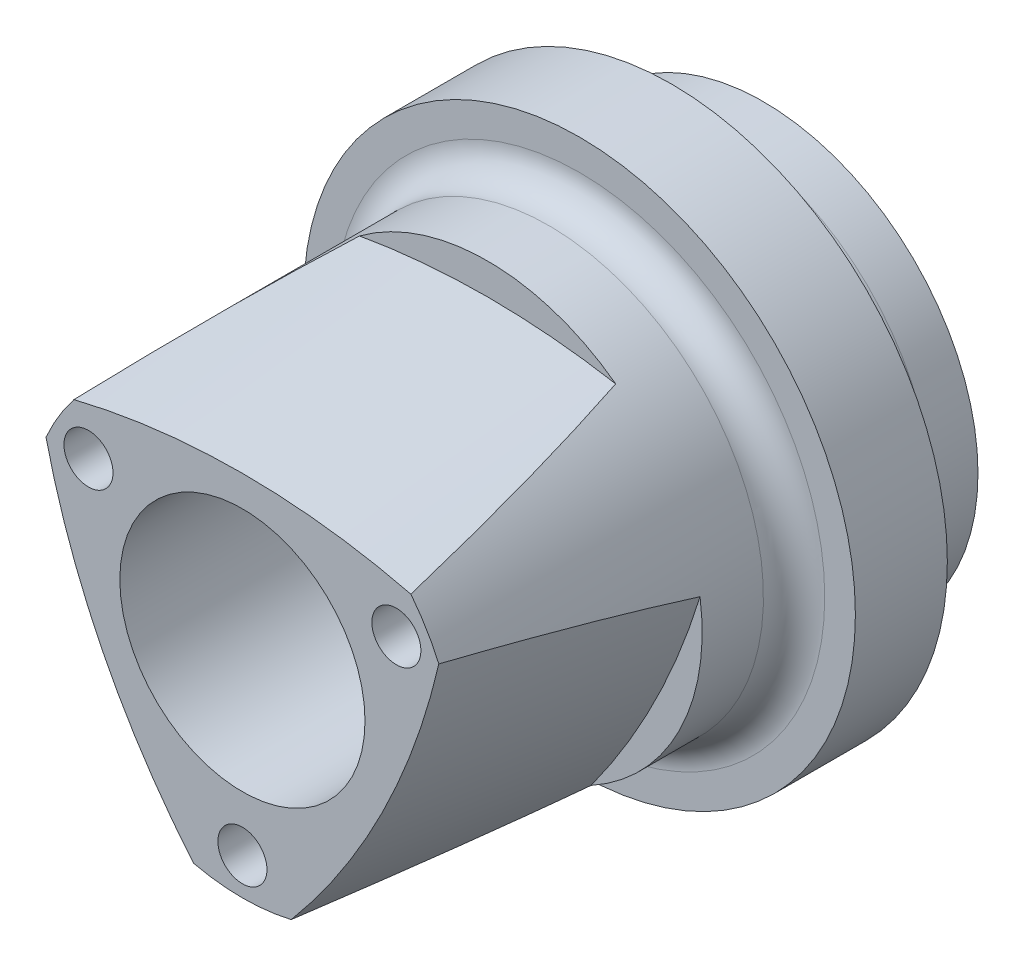
ISO-10303-21;
HEADER;
FILE_DESCRIPTION(('STEP AP214'),'2;1');
FILE_NAME('part.step','',(''),(''),'','','');
FILE_SCHEMA(('AUTOMOTIVE_DESIGN { 1 0 10303 214 1 1 1 1 }'));
ENDSEC;
DATA;
#1=APPLICATION_CONTEXT('core data for automotive mechanical design processes');
#2=APPLICATION_PROTOCOL_DEFINITION('international standard','automotive_design',2000,#1);
#3=PRODUCT_CONTEXT('',#1,'mechanical');
#4=PRODUCT('Part','Part','',(#3));
#5=PRODUCT_RELATED_PRODUCT_CATEGORY('part','',(#4));
#6=PRODUCT_DEFINITION_FORMATION('','',#4);
#7=PRODUCT_DEFINITION_CONTEXT('part definition',#1,'design');
#8=PRODUCT_DEFINITION('design','',#6,#7);
#9=PRODUCT_DEFINITION_SHAPE('','',#8);
#10=(LENGTH_UNIT() NAMED_UNIT(*) SI_UNIT(.MILLI.,.METRE.));
#11=(NAMED_UNIT(*) PLANE_ANGLE_UNIT() SI_UNIT($,.RADIAN.));
#12=(NAMED_UNIT(*) SI_UNIT($,.STERADIAN.) SOLID_ANGLE_UNIT());
#13=UNCERTAINTY_MEASURE_WITH_UNIT(LENGTH_MEASURE(1.E-05),#10,'distance_accuracy_value','');
#14=(GEOMETRIC_REPRESENTATION_CONTEXT(3) GLOBAL_UNCERTAINTY_ASSIGNED_CONTEXT((#13)) GLOBAL_UNIT_ASSIGNED_CONTEXT((#10,
#11,#12)) REPRESENTATION_CONTEXT('',''));
#15=CARTESIAN_POINT('',(0.,0.,0.));
#16=DIRECTION('',(0.,0.,1.));
#17=DIRECTION('',(1.,0.,0.));
#18=AXIS2_PLACEMENT_3D('',#15,#16,#17);
#19=CARTESIAN_POINT('',(0.,0.,95.6883929749474));
#20=DIRECTION('',(0.,0.,1.));
#21=DIRECTION('',(1.,0.,0.));
#22=AXIS2_PLACEMENT_3D('',#19,#20,#21);
#23=CYLINDRICAL_SURFACE('',#22,35.);
#24=CARTESIAN_POINT('',(0.,0.,35.));
#25=DIRECTION('',(0.,0.,-1.));
#26=DIRECTION('',(-1.,0.,0.));
#27=AXIS2_PLACEMENT_3D('',#24,#25,#26);
#28=CIRCLE('',#27,35.);
#29=CARTESIAN_POINT('',(-35.,0.,35.));
#30=VERTEX_POINT('',#29);
#31=EDGE_CURVE('E239',#30,#30,#28,.F.);
#32=ORIENTED_EDGE('',*,*,#31,.T.);
#33=EDGE_LOOP('',(#32));
#34=FACE_BOUND('',#33,.T.);
#35=CARTESIAN_POINT('',(27.4873955710567,21.6666352883934,85.0002));
#36=CARTESIAN_POINT('',(27.279861466066,21.9298847036132,83.3222899095066));
#37=CARTESIAN_POINT('',(27.0658066318707,22.1937030150921,81.6452647692185));
#38=CARTESIAN_POINT('',(26.6234924866197,22.72243172773,78.2932396941321));
#39=CARTESIAN_POINT('',(26.3952329878852,22.9873421432753,76.6182397863904));
#40=CARTESIAN_POINT('',(25.923472473126,23.5180667789278,73.271420093558));
#41=CARTESIAN_POINT('',(25.6799793043651,23.7838804680746,71.599599120874));
#42=CARTESIAN_POINT('',(25.1762389436679,24.3164840368926,68.2586309145805));
#43=CARTESIAN_POINT('',(24.915991720835,24.5832739183631,66.5894836859076));
#44=CARTESIAN_POINT('',(24.377072055562,25.1177709754771,63.2541864976134));
#45=CARTESIAN_POINT('',(24.0983983617293,25.3854782122475,61.5880367494685));
#46=CARTESIAN_POINT('',(23.5206569080366,25.92169063715,58.2594258906012));
#47=CARTESIAN_POINT('',(23.2215894643791,26.1901958128484,56.5969647231001));
#48=CARTESIAN_POINT('',(22.6004829933677,26.7280210488176,53.2755662931263));
#49=CARTESIAN_POINT('',(22.2784325428519,26.9973414496967,51.6166312109981));
#50=CARTESIAN_POINT('',(21.7759555757868,27.4017138975882,49.1321746266402));
#51=CARTESIAN_POINT('',(21.6052243388721,27.5365740378318,48.3046555535688));
#52=CARTESIAN_POINT('',(21.2568269798236,27.8063980251255,46.6510869094097));
#53=CARTESIAN_POINT('',(21.0791607851982,27.9413618732452,45.8250373537774));
#54=CARTESIAN_POINT('',(20.8977937194553,28.0763640391539,44.9998));
#55=B_SPLINE_CURVE_WITH_KNOTS('',3,(#35,#36,#37,#38,#39,#40,#41,#42,#43,#44,#45,#46,#47,#48,#49,
#50,#51,#52,#53,#54),.UNSPECIFIED.,.F.,.F.,(4,2,2,2,2,2,2,2,2,4),(0.,5.13320626434601,
10.2664803654905,15.3971316140098,20.5277923244168,25.6588018307938,30.789731799589,
35.9232299800299,38.4901317521924,41.0570603635301),.UNSPECIFIED.);
#56=CARTESIAN_POINT('',(27.4873708374511,21.6666666666667,85.));
#57=VERTEX_POINT('',#56);
#58=CARTESIAN_POINT('',(20.8978376767969,28.0763313207806,45.));
#59=VERTEX_POINT('',#58);
#60=EDGE_CURVE('E113',#57,#59,#55,.T.);
#61=ORIENTED_EDGE('',*,*,#60,.F.);
#62=CARTESIAN_POINT('',(0.,0.,85.));
#63=DIRECTION('',(0.,0.,1.));
#64=DIRECTION('',(1.,0.,0.));
#65=AXIS2_PLACEMENT_3D('',#62,#63,#64);
#66=CIRCLE('',#65,35.);
#67=CARTESIAN_POINT('',(32.0415945787923,14.0831891575846,85.));
#68=VERTEX_POINT('',#67);
#69=EDGE_CURVE('E123',#68,#57,#66,.T.);
#70=ORIENTED_EDGE('',*,*,#69,.F.);
#71=CARTESIAN_POINT('',(34.6565377713307,4.89125645456522,44.9998));
#72=CARTESIAN_POINT('',(34.6231627165083,5.12766481986519,45.8234169060573));
#73=CARTESIAN_POINT('',(34.5878794360284,5.36024623070054,46.6480478902174));
#74=CARTESIAN_POINT('',(34.5137917540174,5.81826166422605,48.2991221749375));
#75=CARTESIAN_POINT('',(34.4749874055441,6.04369579454738,49.1255654480057));
#76=CARTESIAN_POINT('',(34.3941549533843,6.48791346974399,50.7800106899912));
#77=CARTESIAN_POINT('',(34.3521270939094,6.70669751667622,51.6080125362049));
#78=CARTESIAN_POINT('',(34.2650911730991,7.13806168311669,53.2654755287626));
#79=CARTESIAN_POINT('',(34.2200830989945,7.35064177603716,54.0949366813445));
#80=CARTESIAN_POINT('',(34.0809843095324,7.97940643601307,56.58426004812));
#81=CARTESIAN_POINT('',(33.9827679872189,8.38689168949146,58.2460953779116));
#82=CARTESIAN_POINT('',(33.7768090190525,9.18125346502165,61.5741119479186));
#83=CARTESIAN_POINT('',(33.6690661656139,9.56812953769967,63.2402932820663));
#84=CARTESIAN_POINT('',(33.4452428187558,10.3233140889642,66.5761334352142));
#85=CARTESIAN_POINT('',(33.3291630827024,10.6916242490153,68.245791924984));
#86=CARTESIAN_POINT('',(33.0896223742972,11.411428445575,71.5881884003489));
#87=CARTESIAN_POINT('',(32.9661614265346,11.762922538096,73.2609263756674));
#88=CARTESIAN_POINT('',(32.7125855939204,12.4507552088109,76.6101060611038));
#89=CARTESIAN_POINT('',(32.5824665795999,12.7870841319483,78.2865494373399));
#90=CARTESIAN_POINT('',(32.3163030709182,13.4455234006023,81.6417308230785));
#91=CARTESIAN_POINT('',(32.180258670439,13.7676339712323,83.3204687958175));
#92=CARTESIAN_POINT('',(32.0415780645393,14.0832267301936,85.0002));
#93=B_SPLINE_CURVE_WITH_KNOTS('',3,(#71,#72,#73,#74,#75,#76,#77,#78,#79,#80,#81,#82,#83,#84,#85,
#86,#87,#88,#89,#90,#91,#92),.UNSPECIFIED.,.F.,.F.,(4,2,2,2,2,2,2,2,2,2,4),(0.,2.5725510827491,
5.14506340693301,7.71738103101419,10.2897096774386,15.4311551356055,20.5727126547973,
25.7138036772675,30.8548775741188,35.9991796598991,41.1434002688215),.UNSPECIFIED.);
#94=CARTESIAN_POINT('',(34.6565296685906,4.8913138654248,45.));
#95=VERTEX_POINT('',#94);
#96=EDGE_CURVE('E189',#95,#68,#93,.T.);
#97=ORIENTED_EDGE('',*,*,#96,.F.);
#98=CARTESIAN_POINT('',(0.,0.,45.));
#99=DIRECTION('',(0.,0.,1.));
#100=DIRECTION('',(1.,0.,0.));
#101=AXIS2_PLACEMENT_3D('',#98,#99,#100);
#102=CIRCLE('',#101,35.);
#103=CARTESIAN_POINT('',(16.8808667088145,-30.6600120541274,45.));
#104=VERTEX_POINT('',#103);
#105=EDGE_CURVE('E254',#104,#95,#102,.T.);
#106=ORIENTED_EDGE('',*,*,#105,.F.);
#107=CARTESIAN_POINT('',(7.95836545456876,-34.0831984897475,85.0002));
#108=CARTESIAN_POINT('',(8.29404802527763,-34.0047873190905,83.3204687958175));
#109=CARTESIAN_POINT('',(8.63336312206913,-33.9203564970959,81.6417308230785));
#110=CARTESIAN_POINT('',(9.31981264220134,-33.7382237428489,78.2865494373399));
#111=CARTESIAN_POINT('',(9.66694718930352,-33.6405216004229,76.6101060611038));
#112=CARTESIAN_POINT('',(10.369358825444,-33.4306826640853,73.2609263756673));
#113=CARTESIAN_POINT('',(10.7246306681184,-33.3185549667828,71.5881884003489));
#114=CARTESIAN_POINT('',(11.4441984504091,-33.0783050155711,68.245791924984));
#115=CARTESIAN_POINT('',(11.8084944200821,-32.9501827083832,66.5761334352142));
#116=CARTESIAN_POINT('',(12.5469360692086,-32.676130655111,63.2402932820663));
#117=CARTESIAN_POINT('',(12.9210826394142,-32.530199294255,61.5741119479186));
#118=CARTESIAN_POINT('',(13.6801474407382,-32.21834940347,58.2460953779116));
#119=CARTESIAN_POINT('',(14.0650654369089,-32.0524313092338,56.5842600481199));
#120=CARTESIAN_POINT('',(14.6515364385669,-31.7864515448179,54.0949366813445));
#121=CARTESIAN_POINT('',(14.8486053573661,-31.6949099483493,53.2654755287626));
#122=CARTESIAN_POINT('',(15.2459182430047,-31.5057201851332,51.6080125362049));
#123=CARTESIAN_POINT('',(15.4461621962354,-31.4080720445538,50.7800106899912));
#124=CARTESIAN_POINT('',(15.8500358076886,-31.2062074011637,49.1255654480057));
#125=CARTESIAN_POINT('',(16.0536657210296,-31.1019904017495,48.2991221749375));
#126=CARTESIAN_POINT('',(16.4645306770567,-30.886451287243,46.6480478902174));
#127=CARTESIAN_POINT('',(16.6717657740128,-30.7751290651257,45.8234169060573));
#128=CARTESIAN_POINT('',(16.8809174991463,-30.6599840898037,44.9998));
#129=B_SPLINE_CURVE_WITH_KNOTS('',3,(#107,#108,#109,#110,#111,#112,#113,#114,#115,#116,#117,
#118,#119,#120,#121,#122,#123,#124,#125,#126,#127,#128),.UNSPECIFIED.,.F.,.F.,(4,2,2,2,2,2,2,2,
2,2,4),(0.,5.14422060892244,10.2885226947028,15.429596591554,20.5706876140243,25.7122451332161,
30.853690591383,33.4260192378074,35.9983368618886,38.5708491860725,41.1434002688216),.UNSPECIFIED.);
#130=CARTESIAN_POINT('',(7.95840542120771,-34.0831891575846,85.));
#131=VERTEX_POINT('',#130);
#132=EDGE_CURVE('E183',#131,#104,#129,.T.);
#133=ORIENTED_EDGE('',*,*,#132,.F.);
#134=CARTESIAN_POINT('',(-7.95840542120774,-34.0831891575846,85.));
#135=VERTEX_POINT('',#134);
#136=EDGE_CURVE('E133',#135,#131,#66,.T.);
#137=ORIENTED_EDGE('',*,*,#136,.F.);
#138=CARTESIAN_POINT('',(-16.8809174991463,-30.6599840898037,44.9998));
#139=CARTESIAN_POINT('',(-16.6717657740129,-30.7751290651257,45.8234169060573));
#140=CARTESIAN_POINT('',(-16.4645306770567,-30.886451287243,46.6480478902174));
#141=CARTESIAN_POINT('',(-16.0536657210297,-31.1019904017495,48.2991221749375));
#142=CARTESIAN_POINT('',(-15.8500358076886,-31.2062074011637,49.1255654480057));
#143=CARTESIAN_POINT('',(-15.4461621962355,-31.4080720445538,50.7800106899912));
#144=CARTESIAN_POINT('',(-15.2459182430047,-31.5057201851332,51.6080125362049));
#145=CARTESIAN_POINT('',(-14.8486053573662,-31.6949099483493,53.2654755287626));
#146=CARTESIAN_POINT('',(-14.651536438567,-31.7864515448178,54.0949366813445));
#147=CARTESIAN_POINT('',(-14.065065436909,-32.0524313092337,56.58426004812));
#148=CARTESIAN_POINT('',(-13.6801474407382,-32.21834940347,58.2460953779116));
#149=CARTESIAN_POINT('',(-12.9210826394142,-32.5301992942549,61.5741119479186));
#150=CARTESIAN_POINT('',(-12.5469360692087,-32.6761306551109,63.2402932820663));
#151=CARTESIAN_POINT('',(-11.8084944200822,-32.9501827083831,66.5761334352142));
#152=CARTESIAN_POINT('',(-11.4441984504092,-33.0783050155711,68.245791924984));
#153=CARTESIAN_POINT('',(-10.7246306681184,-33.3185549667828,71.5881884003489));
#154=CARTESIAN_POINT('',(-10.369358825444,-33.4306826640853,73.2609263756673));
#155=CARTESIAN_POINT('',(-9.66694718930357,-33.6405216004229,76.6101060611038));
#156=CARTESIAN_POINT('',(-9.3198126422014,-33.7382237428489,78.2865494373399));
#157=CARTESIAN_POINT('',(-8.63336312206917,-33.9203564970959,81.6417308230785));
#158=CARTESIAN_POINT('',(-8.29404802527765,-34.0047873190905,83.3204687958175));
#159=CARTESIAN_POINT('',(-7.95836545456873,-34.0831984897476,85.0002));
#160=B_SPLINE_CURVE_WITH_KNOTS('',3,(#138,#139,#140,#141,#142,#143,#144,#145,#146,#147,#148,
#149,#150,#151,#152,#153,#154,#155,#156,#157,#158,#159),.UNSPECIFIED.,.F.,.F.,(4,2,2,2,2,2,2,2,
2,2,4),(0.,2.57255108274909,5.14506340693301,7.71738103101417,10.2897096774386,15.4311551356054,
20.5727126547973,25.7138036772675,30.8548775741188,35.9991796598991,41.1434002688215),.UNSPECIFIED.);
#161=CARTESIAN_POINT('',(-16.8808667088146,-30.6600120541274,45.));
#162=VERTEX_POINT('',#161);
#163=EDGE_CURVE('E82',#162,#135,#160,.T.);
#164=ORIENTED_EDGE('',*,*,#163,.F.);
#165=CARTESIAN_POINT('',(0.,0.,45.));
#166=DIRECTION('',(0.,0.,1.));
#167=DIRECTION('',(1.,0.,0.));
#168=AXIS2_PLACEMENT_3D('',#165,#166,#167);
#169=CIRCLE('',#168,35.);
#170=CARTESIAN_POINT('',(-34.6565296685906,4.89131386542475,45.));
#171=VERTEX_POINT('',#170);
#172=EDGE_CURVE('E118',#171,#162,#169,.T.);
#173=ORIENTED_EDGE('',*,*,#172,.F.);
#174=CARTESIAN_POINT('',(-32.0415780645393,14.0832267301935,85.0002));
#175=CARTESIAN_POINT('',(-32.180258670439,13.7676339712322,83.3204687958175));
#176=CARTESIAN_POINT('',(-32.3163030709182,13.4455234006022,81.6417308230785));
#177=CARTESIAN_POINT('',(-32.5824665795999,12.7870841319482,78.2865494373399));
#178=CARTESIAN_POINT('',(-32.7125855939204,12.4507552088109,76.6101060611039));
#179=CARTESIAN_POINT('',(-32.9661614265347,11.762922538096,73.2609263756674));
#180=CARTESIAN_POINT('',(-33.0896223742973,11.411428445575,71.5881884003489));
#181=CARTESIAN_POINT('',(-33.3291630827024,10.6916242490153,68.245791924984));
#182=CARTESIAN_POINT('',(-33.4452428187558,10.3233140889641,66.5761334352142));
#183=CARTESIAN_POINT('',(-33.669066165614,9.56812953769958,63.2402932820663));
#184=CARTESIAN_POINT('',(-33.7768090190525,9.18125346502158,61.5741119479186));
#185=CARTESIAN_POINT('',(-33.9827679872189,8.38689168949141,58.2460953779116));
#186=CARTESIAN_POINT('',(-34.0809843095324,7.97940643601304,56.58426004812));
#187=CARTESIAN_POINT('',(-34.2200830989945,7.35064177603712,54.0949366813445));
#188=CARTESIAN_POINT('',(-34.2650911730991,7.13806168311663,53.2654755287626));
#189=CARTESIAN_POINT('',(-34.3521270939094,6.70669751667615,51.6080125362049));
#190=CARTESIAN_POINT('',(-34.3941549533843,6.48791346974391,50.7800106899912));
#191=CARTESIAN_POINT('',(-34.4749874055441,6.04369579454729,49.1255654480057));
#192=CARTESIAN_POINT('',(-34.5137917540174,5.81826166422596,48.2991221749375));
#193=CARTESIAN_POINT('',(-34.5878794360284,5.36024623070045,46.6480478902174));
#194=CARTESIAN_POINT('',(-34.6231627165083,5.1276648198651,45.8234169060573));
#195=CARTESIAN_POINT('',(-34.6565377713307,4.89125645456515,44.9998));
#196=B_SPLINE_CURVE_WITH_KNOTS('',3,(#174,#175,#176,#177,#178,#179,#180,#181,#182,#183,#184,
#185,#186,#187,#188,#189,#190,#191,#192,#193,#194,#195),.UNSPECIFIED.,.F.,.F.,(4,2,2,2,2,2,2,2,
2,2,4),(0.,5.14422060892243,10.2885226947028,15.429596591554,20.5706876140243,25.7122451332161,
30.8536905913829,33.4260192378074,35.9983368618885,38.5708491860725,41.1434002688216),.UNSPECIFIED.);
#197=CARTESIAN_POINT('',(-32.0415945787923,14.0831891575845,85.));
#198=VERTEX_POINT('',#197);
#199=EDGE_CURVE('E145',#198,#171,#196,.T.);
#200=ORIENTED_EDGE('',*,*,#199,.F.);
#201=CARTESIAN_POINT('',(-27.4873708374511,21.6666666666667,85.));
#202=VERTEX_POINT('',#201);
#203=EDGE_CURVE('E131',#202,#198,#66,.T.);
#204=ORIENTED_EDGE('',*,*,#203,.F.);
#205=CARTESIAN_POINT('',(-20.8977937194553,28.0763640391539,44.9998));
#206=CARTESIAN_POINT('',(-21.0791607851982,27.9413618732452,45.8250373537774));
#207=CARTESIAN_POINT('',(-21.2568269798236,27.8063980251255,46.6510869094097));
#208=CARTESIAN_POINT('',(-21.6052243388721,27.5365740378318,48.3046555535688));
#209=CARTESIAN_POINT('',(-21.7759555757869,27.4017138975882,49.1321746266402));
#210=CARTESIAN_POINT('',(-22.2784325428519,26.9973414496967,51.6166312109981));
#211=CARTESIAN_POINT('',(-22.6004829933677,26.7280210488176,53.2755662931263));
#212=CARTESIAN_POINT('',(-23.2215894643791,26.1901958128484,56.5969647231001));
#213=CARTESIAN_POINT('',(-23.5206569080366,25.92169063715,58.2594258906011));
#214=CARTESIAN_POINT('',(-24.0983983617293,25.3854782122475,61.5880367494685));
#215=CARTESIAN_POINT('',(-24.377072055562,25.1177709754771,63.2541864976134));
#216=CARTESIAN_POINT('',(-24.915991720835,24.5832739183632,66.5894836859076));
#217=CARTESIAN_POINT('',(-25.1762389436679,24.3164840368926,68.2586309145805));
#218=CARTESIAN_POINT('',(-25.6799793043651,23.7838804680746,71.5995991208739));
#219=CARTESIAN_POINT('',(-25.923472473126,23.5180667789279,73.271420093558));
#220=CARTESIAN_POINT('',(-26.3952329878851,22.9873421432753,76.6182397863904));
#221=CARTESIAN_POINT('',(-26.6234924866196,22.72243172773,78.2932396941321));
#222=CARTESIAN_POINT('',(-27.0658066318707,22.1937030150921,81.6452647692185));
#223=CARTESIAN_POINT('',(-27.2798614660661,21.9298847036132,83.3222899095066));
#224=CARTESIAN_POINT('',(-27.4873955710567,21.6666352883933,85.0002));
#225=B_SPLINE_CURVE_WITH_KNOTS('',3,(#205,#206,#207,#208,#209,#210,#211,#212,#213,#214,#215,
#216,#217,#218,#219,#220,#221,#222,#223,#224),.UNSPECIFIED.,.F.,.F.,(4,2,2,2,2,2,2,2,2,4),(0.,
2.56692861133769,5.13383038350026,10.2673285639411,15.3982585327363,20.5292680391133,
25.6599287495203,30.7905799980396,35.9238540991841,41.0570603635301),.UNSPECIFIED.);
#226=CARTESIAN_POINT('',(-20.8978376767969,28.0763313207806,45.));
#227=VERTEX_POINT('',#226);
#228=EDGE_CURVE('E74',#227,#202,#225,.T.);
#229=ORIENTED_EDGE('',*,*,#228,.F.);
#230=CARTESIAN_POINT('',(0.,0.,45.));
#231=DIRECTION('',(0.,0.,1.));
#232=DIRECTION('',(1.,0.,0.));
#233=AXIS2_PLACEMENT_3D('',#230,#231,#232);
#234=CIRCLE('',#233,35.);
#235=EDGE_CURVE('E12',#59,#227,#234,.T.);
#236=ORIENTED_EDGE('',*,*,#235,.F.);
#237=EDGE_LOOP('',(#61,#70,#97,#106,#133,#137,#164,#173,#200,#204,#229,#236));
#238=FACE_BOUND('',#237,.T.);
#239=ADVANCED_FACE('F59',(#34,#238),#23,.T.);
#240=CARTESIAN_POINT('',(0.,35.,85.));
#241=DIRECTION('',(0.,0.,-1.));
#242=DIRECTION('',(-1.,0.,0.));
#243=AXIS2_PLACEMENT_3D('',#240,#241,#242);
#244=PLANE('',#243);
#245=CARTESIAN_POINT('',(25.1147367097487,14.5000000000001,85.));
#246=DIRECTION('',(0.,0.,1.));
#247=DIRECTION('',(1.,0.,0.));
#248=AXIS2_PLACEMENT_3D('',#245,#246,#247);
#249=CIRCLE('',#248,3.99999999999999);
#250=CARTESIAN_POINT('',(29.1147367097487,14.5000000000001,85.));
#251=VERTEX_POINT('',#250);
#252=EDGE_CURVE('E266',#251,#251,#249,.T.);
#253=ORIENTED_EDGE('',*,*,#252,.F.);
#254=EDGE_LOOP('',(#253));
#255=FACE_BOUND('',#254,.T.);
#256=CARTESIAN_POINT('',(-25.1147367097487,14.5000000000001,85.));
#257=DIRECTION('',(0.,0.,1.));
#258=DIRECTION('',(1.,0.,0.));
#259=AXIS2_PLACEMENT_3D('',#256,#257,#258);
#260=CIRCLE('',#259,4.);
#261=CARTESIAN_POINT('',(-21.1147367097487,14.5000000000001,85.));
#262=VERTEX_POINT('',#261);
#263=EDGE_CURVE('E275',#262,#262,#260,.T.);
#264=ORIENTED_EDGE('',*,*,#263,.F.);
#265=EDGE_LOOP('',(#264));
#266=FACE_BOUND('',#265,.T.);
#267=CARTESIAN_POINT('',(0.,-29.,85.));
#268=DIRECTION('',(0.,0.,1.));
#269=DIRECTION('',(1.,0.,0.));
#270=AXIS2_PLACEMENT_3D('',#267,#268,#269);
#271=CIRCLE('',#270,4.);
#272=CARTESIAN_POINT('',(4.,-29.,85.));
#273=VERTEX_POINT('',#272);
#274=EDGE_CURVE('E269',#273,#273,#271,.T.);
#275=ORIENTED_EDGE('',*,*,#274,.F.);
#276=EDGE_LOOP('',(#275));
#277=FACE_BOUND('',#276,.T.);
#278=CARTESIAN_POINT('',(0.,0.,85.));
#279=DIRECTION('',(0.,0.,1.));
#280=DIRECTION('',(1.,0.,0.));
#281=AXIS2_PLACEMENT_3D('',#278,#279,#280);
#282=CIRCLE('',#281,20.);
#283=CARTESIAN_POINT('',(20.,0.,85.));
#284=VERTEX_POINT('',#283);
#285=EDGE_CURVE('E138',#284,#284,#282,.T.);
#286=ORIENTED_EDGE('',*,*,#285,.F.);
#287=EDGE_LOOP('',(#286));
#288=FACE_BOUND('',#287,.T.);
#289=CARTESIAN_POINT('',(0.,-90.,85.));
#290=DIRECTION('',(0.,0.,-1.));
#291=DIRECTION('',(-1.,0.,0.));
#292=AXIS2_PLACEMENT_3D('',#289,#290,#291);
#293=CIRCLE('',#292,115.);
#294=EDGE_CURVE('E67',#202,#57,#293,.T.);
#295=ORIENTED_EDGE('',*,*,#294,.F.);
#296=ORIENTED_EDGE('',*,*,#203,.T.);
#297=CARTESIAN_POINT('',(80.,40.,85.));
#298=DIRECTION('',(0.,0.,-1.));
#299=DIRECTION('',(-1.,0.,0.));
#300=AXIS2_PLACEMENT_3D('',#297,#298,#299);
#301=CIRCLE('',#300,115.);
#302=EDGE_CURVE('E252',#135,#198,#301,.T.);
#303=ORIENTED_EDGE('',*,*,#302,.F.);
#304=ORIENTED_EDGE('',*,*,#136,.T.);
#305=CARTESIAN_POINT('',(-80.,40.,85.));
#306=DIRECTION('',(0.,0.,-1.));
#307=DIRECTION('',(-1.,0.,0.));
#308=AXIS2_PLACEMENT_3D('',#305,#306,#307);
#309=CIRCLE('',#308,115.);
#310=EDGE_CURVE('E129',#68,#131,#309,.T.);
#311=ORIENTED_EDGE('',*,*,#310,.F.);
#312=ORIENTED_EDGE('',*,*,#69,.T.);
#313=EDGE_LOOP('',(#295,#296,#303,#304,#311,#312));
#314=FACE_BOUND('',#313,.T.);
#315=ADVANCED_FACE('F127',(#255,#266,#277,#288,#314),#244,.F.);
#316=CARTESIAN_POINT('',(0.,20.,0.));
#317=DIRECTION('',(0.,0.,1.));
#318=DIRECTION('',(1.,0.,0.));
#319=AXIS2_PLACEMENT_3D('',#316,#317,#318);
#320=PLANE('',#319);
#321=CARTESIAN_POINT('',(25.1147367097487,14.5000000000001,0.));
#322=DIRECTION('',(0.,0.,1.));
#323=DIRECTION('',(1.,0.,0.));
#324=AXIS2_PLACEMENT_3D('',#321,#322,#323);
#325=CIRCLE('',#324,3.99999999999999);
#326=CARTESIAN_POINT('',(29.1147367097487,14.5000000000001,0.));
#327=VERTEX_POINT('',#326);
#328=EDGE_CURVE('E264',#327,#327,#325,.T.);
#329=ORIENTED_EDGE('',*,*,#328,.T.);
#330=EDGE_LOOP('',(#329));
#331=FACE_BOUND('',#330,.T.);
#332=CARTESIAN_POINT('',(-25.1147367097487,14.5000000000001,0.));
#333=DIRECTION('',(0.,0.,1.));
#334=DIRECTION('',(1.,0.,0.));
#335=AXIS2_PLACEMENT_3D('',#332,#333,#334);
#336=CIRCLE('',#335,4.);
#337=CARTESIAN_POINT('',(-21.1147367097487,14.5000000000001,0.));
#338=VERTEX_POINT('',#337);
#339=EDGE_CURVE('E278',#338,#338,#336,.T.);
#340=ORIENTED_EDGE('',*,*,#339,.T.);
#341=EDGE_LOOP('',(#340));
#342=FACE_BOUND('',#341,.T.);
#343=CARTESIAN_POINT('',(0.,-29.,0.));
#344=DIRECTION('',(0.,0.,1.));
#345=DIRECTION('',(1.,0.,0.));
#346=AXIS2_PLACEMENT_3D('',#343,#344,#345);
#347=CIRCLE('',#346,4.);
#348=CARTESIAN_POINT('',(4.,-29.,0.));
#349=VERTEX_POINT('',#348);
#350=EDGE_CURVE('E272',#349,#349,#347,.T.);
#351=ORIENTED_EDGE('',*,*,#350,.T.);
#352=EDGE_LOOP('',(#351));
#353=FACE_BOUND('',#352,.T.);
#354=CARTESIAN_POINT('',(0.,0.,0.));
#355=DIRECTION('',(0.,0.,1.));
#356=DIRECTION('',(1.,0.,0.));
#357=AXIS2_PLACEMENT_3D('',#354,#355,#356);
#358=CIRCLE('',#357,35.);
#359=CARTESIAN_POINT('',(35.,0.,0.));
#360=VERTEX_POINT('',#359);
#361=EDGE_CURVE('E302',#360,#360,#358,.T.);
#362=ORIENTED_EDGE('',*,*,#361,.F.);
#363=EDGE_LOOP('',(#362));
#364=FACE_BOUND('',#363,.T.);
#365=CARTESIAN_POINT('',(0.,0.,0.));
#366=DIRECTION('',(0.,0.,1.));
#367=DIRECTION('',(1.,0.,0.));
#368=AXIS2_PLACEMENT_3D('',#365,#366,#367);
#369=CIRCLE('',#368,20.);
#370=CARTESIAN_POINT('',(20.,0.,0.));
#371=VERTEX_POINT('',#370);
#372=EDGE_CURVE('E141',#371,#371,#369,.T.);
#373=ORIENTED_EDGE('',*,*,#372,.T.);
#374=EDGE_LOOP('',(#373));
#375=FACE_BOUND('',#374,.T.);
#376=ADVANCED_FACE('F235',(#331,#342,#353,#364,#375),#320,.F.);
#377=CARTESIAN_POINT('',(0.,0.,95.6883929749474));
#378=DIRECTION('',(0.,0.,1.));
#379=DIRECTION('',(1.,0.,0.));
#380=AXIS2_PLACEMENT_3D('',#377,#378,#379);
#381=CYLINDRICAL_SURFACE('',#380,35.);
#382=CARTESIAN_POINT('',(0.,0.,7.49999999999999));
#383=DIRECTION('',(0.,0.,1.));
#384=DIRECTION('',(1.,0.,0.));
#385=AXIS2_PLACEMENT_3D('',#382,#383,#384);
#386=CIRCLE('',#385,35.);
#387=CARTESIAN_POINT('',(35.,0.,7.49999999999999));
#388=VERTEX_POINT('',#387);
#389=EDGE_CURVE('E242',#388,#388,#386,.F.);
#390=ORIENTED_EDGE('',*,*,#389,.T.);
#391=EDGE_LOOP('',(#390));
#392=FACE_BOUND('',#391,.T.);
#393=ORIENTED_EDGE('',*,*,#361,.T.);
#394=EDGE_LOOP('',(#393));
#395=FACE_BOUND('',#394,.T.);
#396=ADVANCED_FACE('F294',(#392,#395),#381,.T.);
#397=CARTESIAN_POINT('',(0.,35.,15.));
#398=DIRECTION('',(0.,0.,1.));
#399=DIRECTION('',(1.,0.,0.));
#400=AXIS2_PLACEMENT_3D('',#397,#398,#399);
#401=PLANE('',#400);
#402=CARTESIAN_POINT('',(0.,0.,15.));
#403=DIRECTION('',(0.,0.,1.));
#404=DIRECTION('',(1.,0.,0.));
#405=AXIS2_PLACEMENT_3D('',#402,#403,#404);
#406=CIRCLE('',#405,42.5);
#407=CARTESIAN_POINT('',(42.5,0.,15.));
#408=VERTEX_POINT('',#407);
#409=EDGE_CURVE('E247',#408,#408,#406,.T.);
#410=ORIENTED_EDGE('',*,*,#409,.T.);
#411=EDGE_LOOP('',(#410));
#412=FACE_BOUND('',#411,.T.);
#413=CARTESIAN_POINT('',(0.,0.,15.));
#414=DIRECTION('',(0.,0.,1.));
#415=DIRECTION('',(1.,0.,0.));
#416=AXIS2_PLACEMENT_3D('',#413,#414,#415);
#417=CIRCLE('',#416,45.);
#418=CARTESIAN_POINT('',(45.,0.,15.));
#419=VERTEX_POINT('',#418);
#420=EDGE_CURVE('E135',#419,#419,#417,.T.);
#421=ORIENTED_EDGE('',*,*,#420,.F.);
#422=EDGE_LOOP('',(#421));
#423=FACE_BOUND('',#422,.T.);
#424=ADVANCED_FACE('F318',(#412,#423),#401,.F.);
#425=CARTESIAN_POINT('',(0.,0.,95.6883929749474));
#426=DIRECTION('',(0.,0.,1.));
#427=DIRECTION('',(1.,0.,0.));
#428=AXIS2_PLACEMENT_3D('',#425,#426,#427);
#429=CYLINDRICAL_SURFACE('',#428,45.);
#430=CARTESIAN_POINT('',(0.,0.,30.));
#431=DIRECTION('',(0.,0.,1.));
#432=DIRECTION('',(1.,0.,0.));
#433=AXIS2_PLACEMENT_3D('',#430,#431,#432);
#434=CIRCLE('',#433,45.);
#435=CARTESIAN_POINT('',(45.,0.,30.));
#436=VERTEX_POINT('',#435);
#437=EDGE_CURVE('E130',#436,#436,#434,.T.);
#438=ORIENTED_EDGE('',*,*,#437,.F.);
#439=EDGE_LOOP('',(#438));
#440=FACE_BOUND('',#439,.T.);
#441=ORIENTED_EDGE('',*,*,#420,.T.);
#442=EDGE_LOOP('',(#441));
#443=FACE_BOUND('',#442,.T.);
#444=ADVANCED_FACE('F313',(#440,#443),#429,.T.);
#445=CARTESIAN_POINT('',(0.,45.,30.));
#446=DIRECTION('',(0.,0.,-1.));
#447=DIRECTION('',(-1.,0.,0.));
#448=AXIS2_PLACEMENT_3D('',#445,#446,#447);
#449=PLANE('',#448);
#450=CARTESIAN_POINT('',(0.,0.,30.));
#451=DIRECTION('',(0.,0.,-1.));
#452=DIRECTION('',(-1.,0.,0.));
#453=AXIS2_PLACEMENT_3D('',#450,#451,#452);
#454=CIRCLE('',#453,40.);
#455=CARTESIAN_POINT('',(-40.,0.,30.));
#456=VERTEX_POINT('',#455);
#457=EDGE_CURVE('E241',#456,#456,#454,.T.);
#458=ORIENTED_EDGE('',*,*,#457,.T.);
#459=EDGE_LOOP('',(#458));
#460=FACE_BOUND('',#459,.T.);
#461=ORIENTED_EDGE('',*,*,#437,.T.);
#462=EDGE_LOOP('',(#461));
#463=FACE_BOUND('',#462,.T.);
#464=ADVANCED_FACE('F307',(#460,#463),#449,.F.);
#465=CARTESIAN_POINT('',(0.,0.,95.6883929749474));
#466=DIRECTION('',(0.,0.,1.));
#467=DIRECTION('',(1.,0.,0.));
#468=AXIS2_PLACEMENT_3D('',#465,#466,#467);
#469=CYLINDRICAL_SURFACE('',#468,20.);
#470=ORIENTED_EDGE('',*,*,#372,.F.);
#471=EDGE_LOOP('',(#470));
#472=FACE_BOUND('',#471,.T.);
#473=ORIENTED_EDGE('',*,*,#285,.T.);
#474=EDGE_LOOP('',(#473));
#475=FACE_BOUND('',#474,.T.);
#476=ADVANCED_FACE('F181',(#472,#475),#469,.F.);
#477=CARTESIAN_POINT('',(0.,0.,7.49999999999999));
#478=DIRECTION('',(0.,0.,1.));
#479=DIRECTION('',(1.,0.,0.));
#480=AXIS2_PLACEMENT_3D('',#477,#478,#479);
#481=TOROIDAL_SURFACE('',#480,42.5,7.5);
#482=ORIENTED_EDGE('',*,*,#389,.F.);
#483=EDGE_LOOP('',(#482));
#484=FACE_BOUND('',#483,.T.);
#485=ORIENTED_EDGE('',*,*,#409,.F.);
#486=EDGE_LOOP('',(#485));
#487=FACE_BOUND('',#486,.T.);
#488=ADVANCED_FACE('F306',(#484,#487),#481,.F.);
#489=CARTESIAN_POINT('',(0.,0.,35.));
#490=DIRECTION('',(0.,0.,-1.));
#491=DIRECTION('',(-1.,0.,0.));
#492=AXIS2_PLACEMENT_3D('',#489,#490,#491);
#493=TOROIDAL_SURFACE('',#492,40.,5.);
#494=ORIENTED_EDGE('',*,*,#457,.F.);
#495=EDGE_LOOP('',(#494));
#496=FACE_BOUND('',#495,.T.);
#497=ORIENTED_EDGE('',*,*,#31,.F.);
#498=EDGE_LOOP('',(#497));
#499=FACE_BOUND('',#498,.T.);
#500=ADVANCED_FACE('F61',(#496,#499),#493,.F.);
#501=CARTESIAN_POINT('',(0.,0.,45.));
#502=DIRECTION('',(0.,0.,1.));
#503=DIRECTION('',(1.,0.,0.));
#504=AXIS2_PLACEMENT_3D('',#501,#502,#503);
#505=PLANE('',#504);
#506=ORIENTED_EDGE('',*,*,#105,.T.);
#507=CARTESIAN_POINT('',(-80.,40.,45.));
#508=DIRECTION('',(0.,0.,1.));
#509=DIRECTION('',(1.,0.,0.));
#510=AXIS2_PLACEMENT_3D('',#507,#508,#509);
#511=CIRCLE('',#510,119.911382436116);
#512=EDGE_CURVE('E124',#104,#95,#511,.T.);
#513=ORIENTED_EDGE('',*,*,#512,.F.);
#514=EDGE_LOOP('',(#506,#513));
#515=FACE_BOUND('',#514,.T.);
#516=ADVANCED_FACE('F171',(#515),#505,.T.);
#517=CARTESIAN_POINT('',(-80.,40.,85.));
#518=DIRECTION('',(0.,0.,-1.));
#519=DIRECTION('',(1.,0.,0.));
#520=AXIS2_PLACEMENT_3D('',#517,#518,#519);
#521=CONICAL_SURFACE('',#520,115.,0.122173047639604);
#522=ORIENTED_EDGE('',*,*,#132,.T.);
#523=ORIENTED_EDGE('',*,*,#512,.T.);
#524=ORIENTED_EDGE('',*,*,#96,.T.);
#525=ORIENTED_EDGE('',*,*,#310,.T.);
#526=EDGE_LOOP('',(#522,#523,#524,#525));
#527=FACE_BOUND('',#526,.T.);
#528=ADVANCED_FACE('F175',(#527),#521,.T.);
#529=CARTESIAN_POINT('',(0.,0.,45.));
#530=DIRECTION('',(0.,0.,1.));
#531=DIRECTION('',(1.,0.,0.));
#532=AXIS2_PLACEMENT_3D('',#529,#530,#531);
#533=PLANE('',#532);
#534=ORIENTED_EDGE('',*,*,#172,.T.);
#535=CARTESIAN_POINT('',(80.,40.,45.));
#536=DIRECTION('',(0.,0.,1.));
#537=DIRECTION('',(1.,0.,0.));
#538=AXIS2_PLACEMENT_3D('',#535,#536,#537);
#539=CIRCLE('',#538,119.911382436116);
#540=EDGE_CURVE('E195',#171,#162,#539,.T.);
#541=ORIENTED_EDGE('',*,*,#540,.F.);
#542=EDGE_LOOP('',(#534,#541));
#543=FACE_BOUND('',#542,.T.);
#544=ADVANCED_FACE('F169',(#543),#533,.T.);
#545=CARTESIAN_POINT('',(80.,40.,85.));
#546=DIRECTION('',(0.,0.,-1.));
#547=DIRECTION('',(1.,0.,0.));
#548=AXIS2_PLACEMENT_3D('',#545,#546,#547);
#549=CONICAL_SURFACE('',#548,115.,0.122173047639604);
#550=ORIENTED_EDGE('',*,*,#199,.T.);
#551=ORIENTED_EDGE('',*,*,#540,.T.);
#552=ORIENTED_EDGE('',*,*,#163,.T.);
#553=ORIENTED_EDGE('',*,*,#302,.T.);
#554=EDGE_LOOP('',(#550,#551,#552,#553));
#555=FACE_BOUND('',#554,.T.);
#556=ADVANCED_FACE('F163',(#555),#549,.T.);
#557=CARTESIAN_POINT('',(0.,0.,45.));
#558=DIRECTION('',(0.,0.,1.));
#559=DIRECTION('',(1.,0.,0.));
#560=AXIS2_PLACEMENT_3D('',#557,#558,#559);
#561=PLANE('',#560);
#562=ORIENTED_EDGE('',*,*,#235,.T.);
#563=CARTESIAN_POINT('',(0.,-90.,45.));
#564=DIRECTION('',(0.,0.,1.));
#565=DIRECTION('',(1.,0.,0.));
#566=AXIS2_PLACEMENT_3D('',#563,#564,#565);
#567=CIRCLE('',#566,119.911382436116);
#568=EDGE_CURVE('E263',#59,#227,#567,.T.);
#569=ORIENTED_EDGE('',*,*,#568,.F.);
#570=EDGE_LOOP('',(#562,#569));
#571=FACE_BOUND('',#570,.T.);
#572=ADVANCED_FACE('F168',(#571),#561,.T.);
#573=CARTESIAN_POINT('',(0.,-90.,85.));
#574=DIRECTION('',(0.,0.,-1.));
#575=DIRECTION('',(1.,0.,0.));
#576=AXIS2_PLACEMENT_3D('',#573,#574,#575);
#577=CONICAL_SURFACE('',#576,115.,0.122173047639604);
#578=ORIENTED_EDGE('',*,*,#60,.T.);
#579=ORIENTED_EDGE('',*,*,#568,.T.);
#580=ORIENTED_EDGE('',*,*,#228,.T.);
#581=ORIENTED_EDGE('',*,*,#294,.T.);
#582=EDGE_LOOP('',(#578,#579,#580,#581));
#583=FACE_BOUND('',#582,.T.);
#584=ADVANCED_FACE('F112',(#583),#577,.T.);
#585=CARTESIAN_POINT('',(0.,-29.,0.));
#586=DIRECTION('',(0.,0.,1.));
#587=DIRECTION('',(1.,0.,0.));
#588=AXIS2_PLACEMENT_3D('',#585,#586,#587);
#589=CYLINDRICAL_SURFACE('',#588,4.);
#590=ORIENTED_EDGE('',*,*,#350,.F.);
#591=EDGE_LOOP('',(#590));
#592=FACE_BOUND('',#591,.T.);
#593=ORIENTED_EDGE('',*,*,#274,.T.);
#594=EDGE_LOOP('',(#593));
#595=FACE_BOUND('',#594,.T.);
#596=ADVANCED_FACE('F211',(#592,#595),#589,.F.);
#597=CARTESIAN_POINT('',(-25.1147367097487,14.5000000000001,0.));
#598=DIRECTION('',(0.,0.,1.));
#599=DIRECTION('',(1.,0.,0.));
#600=AXIS2_PLACEMENT_3D('',#597,#598,#599);
#601=CYLINDRICAL_SURFACE('',#600,4.);
#602=ORIENTED_EDGE('',*,*,#339,.F.);
#603=EDGE_LOOP('',(#602));
#604=FACE_BOUND('',#603,.T.);
#605=ORIENTED_EDGE('',*,*,#263,.T.);
#606=EDGE_LOOP('',(#605));
#607=FACE_BOUND('',#606,.T.);
#608=ADVANCED_FACE('F218',(#604,#607),#601,.F.);
#609=CARTESIAN_POINT('',(25.1147367097487,14.5000000000001,0.));
#610=DIRECTION('',(0.,0.,1.));
#611=DIRECTION('',(1.,0.,0.));
#612=AXIS2_PLACEMENT_3D('',#609,#610,#611);
#613=CYLINDRICAL_SURFACE('',#612,3.99999999999999);
#614=ORIENTED_EDGE('',*,*,#328,.F.);
#615=EDGE_LOOP('',(#614));
#616=FACE_BOUND('',#615,.T.);
#617=ORIENTED_EDGE('',*,*,#252,.T.);
#618=EDGE_LOOP('',(#617));
#619=FACE_BOUND('',#618,.T.);
#620=ADVANCED_FACE('F222',(#616,#619),#613,.F.);
#621=CLOSED_SHELL('',(#239,#315,#376,#396,#424,#444,#464,#476,#488,#500,#516,#528,#544,#556,
#572,#584,#596,#608,#620));
#622=MANIFOLD_SOLID_BREP('B2',#621);
#623=ADVANCED_BREP_SHAPE_REPRESENTATION('',(#18,#622),#14);
#624=SHAPE_DEFINITION_REPRESENTATION(#9,#623);
ENDSEC;
END-ISO-10303-21;
